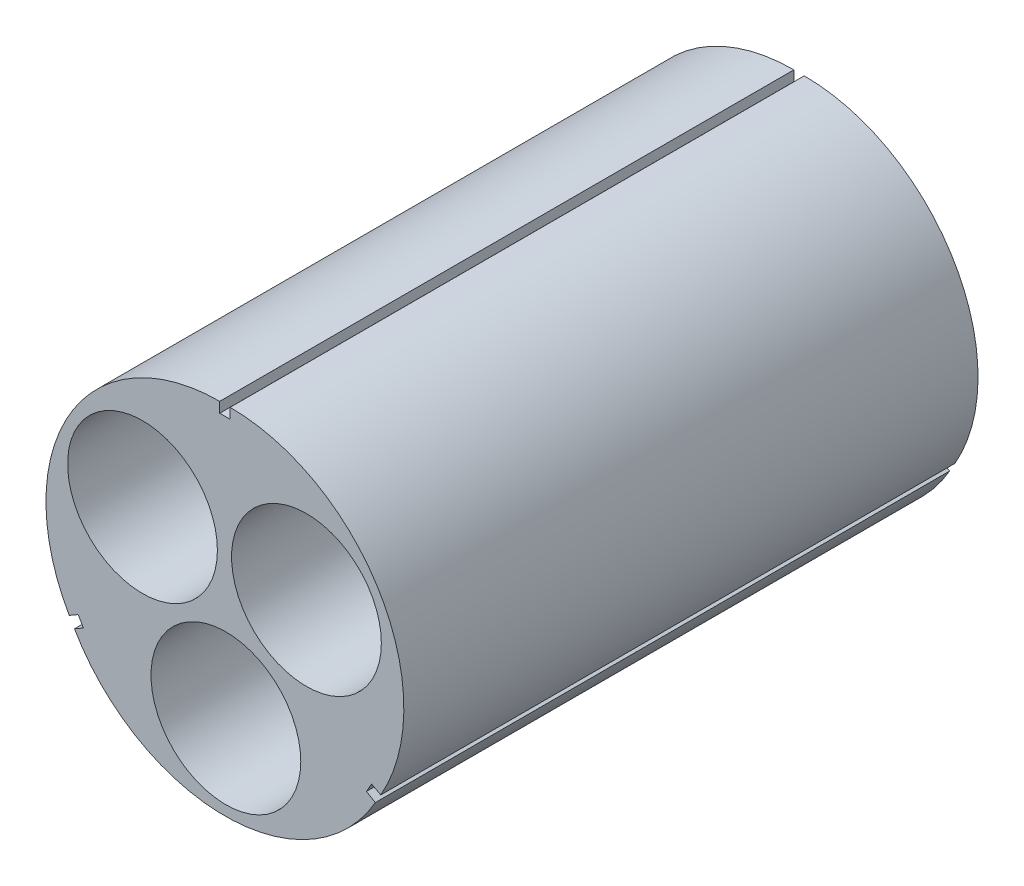
ISO-10303-21;
HEADER;
FILE_DESCRIPTION(('STEP AP214'),'2;1');
FILE_NAME('part.step','',(''),(''),'','','');
FILE_SCHEMA(('AUTOMOTIVE_DESIGN { 1 0 10303 214 1 1 1 1 }'));
ENDSEC;
DATA;
#1=APPLICATION_CONTEXT('core data for automotive mechanical design processes');
#2=APPLICATION_PROTOCOL_DEFINITION('international standard','automotive_design',2000,#1);
#3=PRODUCT_CONTEXT('',#1,'mechanical');
#4=PRODUCT('Part','Part','',(#3));
#5=PRODUCT_RELATED_PRODUCT_CATEGORY('part','',(#4));
#6=PRODUCT_DEFINITION_FORMATION('','',#4);
#7=PRODUCT_DEFINITION_CONTEXT('part definition',#1,'design');
#8=PRODUCT_DEFINITION('design','',#6,#7);
#9=PRODUCT_DEFINITION_SHAPE('','',#8);
#10=(LENGTH_UNIT() NAMED_UNIT(*) SI_UNIT(.MILLI.,.METRE.));
#11=(NAMED_UNIT(*) PLANE_ANGLE_UNIT() SI_UNIT($,.RADIAN.));
#12=(NAMED_UNIT(*) SI_UNIT($,.STERADIAN.) SOLID_ANGLE_UNIT());
#13=UNCERTAINTY_MEASURE_WITH_UNIT(LENGTH_MEASURE(1.E-05),#10,'distance_accuracy_value','');
#14=(GEOMETRIC_REPRESENTATION_CONTEXT(3) GLOBAL_UNCERTAINTY_ASSIGNED_CONTEXT((#13)) GLOBAL_UNIT_ASSIGNED_CONTEXT((#10,
#11,#12)) REPRESENTATION_CONTEXT('',''));
#15=CARTESIAN_POINT('',(0.,0.,0.));
#16=DIRECTION('',(0.,0.,1.));
#17=DIRECTION('',(1.,0.,0.));
#18=AXIS2_PLACEMENT_3D('',#15,#16,#17);
#19=CARTESIAN_POINT('',(0.634999999997387,0.367389914464188,70.104));
#20=DIRECTION('',(0.,0.,-1.));
#21=DIRECTION('',(-1.,0.,0.));
#22=AXIS2_PLACEMENT_3D('',#19,#20,#21);
#23=PLANE('',#22);
#24=DIRECTION('',(-1.,0.,0.));
#25=VECTOR('',#24,1.);
#26=CARTESIAN_POINT('',(0.,20.32,70.104));
#27=LINE('',#26,#25);
#28=CARTESIAN_POINT('',(0.634999999997387,20.32,70.104));
#29=VERTEX_POINT('',#28);
#30=CARTESIAN_POINT('',(-0.635,20.32,70.104));
#31=VERTEX_POINT('',#30);
#32=EDGE_CURVE('E104',#29,#31,#27,.T.);
#33=ORIENTED_EDGE('',*,*,#32,.T.);
#34=DIRECTION('',(-1.0380533114416E-13,1.,0.));
#35=VECTOR('',#34,1.);
#36=CARTESIAN_POINT('',(-0.635,20.32,70.104));
#37=LINE('',#36,#35);
#38=CARTESIAN_POINT('',(-0.635000000000131,21.5806597443176,70.104));
#39=VERTEX_POINT('',#38);
#40=EDGE_CURVE('E245',#31,#39,#37,.T.);
#41=ORIENTED_EDGE('',*,*,#40,.T.);
#42=CARTESIAN_POINT('',(-0.635,0.366617420935411,70.104));
#43=DIRECTION('',(0.,0.,1.));
#44=DIRECTION('',(1.,0.,0.));
#45=AXIS2_PLACEMENT_3D('',#42,#43,#44);
#46=CIRCLE('',#45,21.2140423233821);
#47=CARTESIAN_POINT('',(-19.0068995690071,-10.2404037407557,70.104));
#48=VERTEX_POINT('',#47);
#49=EDGE_CURVE('E206',#39,#48,#46,.T.);
#50=ORIENTED_EDGE('',*,*,#49,.T.);
#51=DIRECTION('',(0.866025403784438,0.500000000000001,0.));
#52=VECTOR('',#51,1.);
#53=CARTESIAN_POINT('',(-17.9151362048997,-9.61007386859698,70.104));
#54=LINE('',#53,#52);
#55=CARTESIAN_POINT('',(-17.9151362048997,-9.61007386859698,70.104));
#56=VERTEX_POINT('',#55);
#57=EDGE_CURVE('E224',#48,#56,#54,.T.);
#58=ORIENTED_EDGE('',*,*,#57,.T.);
#59=DIRECTION('',(0.500000000000004,-0.866025403784436,0.));
#60=VECTOR('',#59,1.);
#61=CARTESIAN_POINT('',(-17.5976362048997,-10.1600000000001,70.104));
#62=LINE('',#61,#60);
#63=CARTESIAN_POINT('',(-17.2801362048997,-10.7099261314032,70.104));
#64=VERTEX_POINT('',#63);
#65=EDGE_CURVE('E221',#56,#64,#62,.T.);
#66=ORIENTED_EDGE('',*,*,#65,.T.);
#67=DIRECTION('',(-0.866025403784435,-0.500000000000007,0.));
#68=VECTOR('',#67,1.);
#69=CARTESIAN_POINT('',(-17.2801362048997,-10.7099261314032,70.104));
#70=LINE('',#69,#68);
#71=CARTESIAN_POINT('',(-18.371899569007,-11.3402560035619,70.104));
#72=VERTEX_POINT('',#71);
#73=EDGE_CURVE('E223',#64,#72,#70,.T.);
#74=ORIENTED_EDGE('',*,*,#73,.T.);
#75=CARTESIAN_POINT('',(-3.06256712231732E-13,-0.73323484187037,70.104));
#76=DIRECTION('',(0.,0.,1.));
#77=DIRECTION('',(-1.,0.,0.));
#78=AXIS2_PLACEMENT_3D('',#75,#76,#77);
#79=CIRCLE('',#78,21.2140423233818);
#80=CARTESIAN_POINT('',(18.3718995690067,-11.3402560035613,70.104));
#81=VERTEX_POINT('',#80);
#82=EDGE_CURVE('E226',#72,#81,#79,.T.);
#83=ORIENTED_EDGE('',*,*,#82,.T.);
#84=DIRECTION('',(-0.866025403784436,0.500000000000004,0.));
#85=VECTOR('',#84,1.);
#86=CARTESIAN_POINT('',(17.2801362048999,-10.7099261314029,70.104));
#87=LINE('',#86,#85);
#88=CARTESIAN_POINT('',(17.2801362048999,-10.7099261314029,70.104));
#89=VERTEX_POINT('',#88);
#90=EDGE_CURVE('E232',#81,#89,#87,.T.);
#91=ORIENTED_EDGE('',*,*,#90,.T.);
#92=DIRECTION('',(0.500000000000005,0.866025403784436,0.));
#93=VECTOR('',#92,1.);
#94=CARTESIAN_POINT('',(17.5976362048998,-10.1600000000001,70.104));
#95=LINE('',#94,#93);
#96=CARTESIAN_POINT('',(17.9151362048998,-9.61007386859697,70.104));
#97=VERTEX_POINT('',#96);
#98=EDGE_CURVE('E136',#89,#97,#95,.T.);
#99=ORIENTED_EDGE('',*,*,#98,.T.);
#100=DIRECTION('',(0.881220225469593,-0.472705949003521,0.));
#101=VECTOR('',#100,1.);
#102=CARTESIAN_POINT('',(17.9151362048998,-9.61007386859697,70.104));
#103=LINE('',#102,#101);
#104=CARTESIAN_POINT('',(19.0255446678886,-10.2057214389861,70.104));
#105=VERTEX_POINT('',#104);
#106=EDGE_CURVE('E130',#97,#105,#103,.T.);
#107=ORIENTED_EDGE('',*,*,#106,.T.);
#108=CARTESIAN_POINT('',(0.634999999997387,0.367389914464188,70.104));
#109=DIRECTION('',(0.,0.,1.));
#110=DIRECTION('',(-1.,0.,0.));
#111=AXIS2_PLACEMENT_3D('',#108,#109,#110);
#112=CIRCLE('',#111,21.2132698298533);
#113=CARTESIAN_POINT('',(0.634999999997385,21.5806597443175,70.104));
#114=VERTEX_POINT('',#113);
#115=EDGE_CURVE('E134',#105,#114,#112,.T.);
#116=ORIENTED_EDGE('',*,*,#115,.T.);
#117=DIRECTION('',(0.,-1.,0.));
#118=VECTOR('',#117,1.);
#119=CARTESIAN_POINT('',(0.634999999997387,20.32,70.104));
#120=LINE('',#119,#118);
#121=EDGE_CURVE('E50',#114,#29,#120,.T.);
#122=ORIENTED_EDGE('',*,*,#121,.T.);
#123=EDGE_LOOP('',(#33,#41,#50,#58,#66,#74,#83,#91,#99,#107,#116,#122));
#124=FACE_BOUND('',#123,.T.);
#125=CARTESIAN_POINT('',(0.118855303980422,-11.557,70.104));
#126=DIRECTION('',(0.,0.,1.));
#127=DIRECTION('',(1.,0.,0.));
#128=AXIS2_PLACEMENT_3D('',#125,#126,#127);
#129=CIRCLE('',#128,9.144);
#130=CARTESIAN_POINT('',(9.26285530398042,-11.557,70.104));
#131=VERTEX_POINT('',#130);
#132=EDGE_CURVE('E156',#131,#131,#129,.T.);
#133=ORIENTED_EDGE('',*,*,#132,.F.);
#134=EDGE_LOOP('',(#133));
#135=FACE_BOUND('',#134,.T.);
#136=CARTESIAN_POINT('',(9.95557947936446,5.86947069419869,70.104));
#137=DIRECTION('',(0.,0.,1.));
#138=DIRECTION('',(1.,0.,0.));
#139=AXIS2_PLACEMENT_3D('',#136,#137,#138);
#140=CIRCLE('',#139,9.144);
#141=CARTESIAN_POINT('',(19.0995794793645,5.86947069419869,70.104));
#142=VERTEX_POINT('',#141);
#143=EDGE_CURVE('E418',#142,#142,#140,.T.);
#144=ORIENTED_EDGE('',*,*,#143,.F.);
#145=EDGE_LOOP('',(#144));
#146=FACE_BOUND('',#145,.T.);
#147=CARTESIAN_POINT('',(-10.0609004676266,5.68704939142529,70.104));
#148=DIRECTION('',(0.,0.,1.));
#149=DIRECTION('',(1.,0.,0.));
#150=AXIS2_PLACEMENT_3D('',#147,#148,#149);
#151=CIRCLE('',#150,9.144);
#152=CARTESIAN_POINT('',(-0.916900467626609,5.68704939142529,70.104));
#153=VERTEX_POINT('',#152);
#154=EDGE_CURVE('E409',#153,#153,#151,.T.);
#155=ORIENTED_EDGE('',*,*,#154,.F.);
#156=EDGE_LOOP('',(#155));
#157=FACE_BOUND('',#156,.T.);
#158=ADVANCED_FACE('F33',(#124,#135,#146,#157),#23,.F.);
#159=CARTESIAN_POINT('',(0.634999999997387,0.367389914464188,0.));
#160=DIRECTION('',(0.,0.,-1.));
#161=DIRECTION('',(-1.,0.,0.));
#162=AXIS2_PLACEMENT_3D('',#159,#160,#161);
#163=PLANE('',#162);
#164=CARTESIAN_POINT('',(9.95557947936446,5.86947069419869,0.));
#165=DIRECTION('',(0.,0.,1.));
#166=DIRECTION('',(1.,0.,0.));
#167=AXIS2_PLACEMENT_3D('',#164,#165,#166);
#168=CIRCLE('',#167,9.144);
#169=CARTESIAN_POINT('',(19.0995794793645,5.86947069419869,0.));
#170=VERTEX_POINT('',#169);
#171=EDGE_CURVE('E415',#170,#170,#168,.T.);
#172=ORIENTED_EDGE('',*,*,#171,.T.);
#173=EDGE_LOOP('',(#172));
#174=FACE_BOUND('',#173,.T.);
#175=DIRECTION('',(-1.,0.,0.));
#176=VECTOR('',#175,1.);
#177=CARTESIAN_POINT('',(0.,20.32,0.));
#178=LINE('',#177,#176);
#179=CARTESIAN_POINT('',(0.634999999997387,20.32,0.));
#180=VERTEX_POINT('',#179);
#181=CARTESIAN_POINT('',(-0.635,20.32,0.));
#182=VERTEX_POINT('',#181);
#183=EDGE_CURVE('E98',#180,#182,#178,.T.);
#184=ORIENTED_EDGE('',*,*,#183,.F.);
#185=DIRECTION('',(0.,-1.,0.));
#186=VECTOR('',#185,1.);
#187=CARTESIAN_POINT('',(0.634999999997387,20.32,0.));
#188=LINE('',#187,#186);
#189=CARTESIAN_POINT('',(0.634999999997385,21.5806597443175,0.));
#190=VERTEX_POINT('',#189);
#191=EDGE_CURVE('E176',#190,#180,#188,.T.);
#192=ORIENTED_EDGE('',*,*,#191,.F.);
#193=CARTESIAN_POINT('',(0.634999999997387,0.367389914464188,0.));
#194=DIRECTION('',(0.,0.,1.));
#195=DIRECTION('',(-1.,0.,0.));
#196=AXIS2_PLACEMENT_3D('',#193,#194,#195);
#197=CIRCLE('',#196,21.2132698298533);
#198=CARTESIAN_POINT('',(19.0255446678886,-10.2057214389861,0.));
#199=VERTEX_POINT('',#198);
#200=EDGE_CURVE('E91',#199,#190,#197,.T.);
#201=ORIENTED_EDGE('',*,*,#200,.F.);
#202=DIRECTION('',(0.881220225469593,-0.472705949003521,0.));
#203=VECTOR('',#202,1.);
#204=CARTESIAN_POINT('',(17.9151362048998,-9.61007386859697,0.));
#205=LINE('',#204,#203);
#206=CARTESIAN_POINT('',(17.9151362048998,-9.61007386859697,0.));
#207=VERTEX_POINT('',#206);
#208=EDGE_CURVE('E144',#207,#199,#205,.T.);
#209=ORIENTED_EDGE('',*,*,#208,.F.);
#210=DIRECTION('',(0.500000000000003,0.866025403784437,0.));
#211=VECTOR('',#210,1.);
#212=CARTESIAN_POINT('',(17.5976362048998,-10.1600000000001,0.));
#213=LINE('',#212,#211);
#214=CARTESIAN_POINT('',(17.2801362048999,-10.7099261314029,0.));
#215=VERTEX_POINT('',#214);
#216=EDGE_CURVE('E172',#215,#207,#213,.T.);
#217=ORIENTED_EDGE('',*,*,#216,.F.);
#218=DIRECTION('',(-0.866025403784436,0.500000000000004,0.));
#219=VECTOR('',#218,1.);
#220=CARTESIAN_POINT('',(17.2801362048999,-10.7099261314029,0.));
#221=LINE('',#220,#219);
#222=CARTESIAN_POINT('',(18.3718995690067,-11.3402560035613,0.));
#223=VERTEX_POINT('',#222);
#224=EDGE_CURVE('E169',#223,#215,#221,.T.);
#225=ORIENTED_EDGE('',*,*,#224,.F.);
#226=CARTESIAN_POINT('',(-3.06256712231732E-13,-0.73323484187037,0.));
#227=DIRECTION('',(0.,0.,1.));
#228=DIRECTION('',(-1.,0.,0.));
#229=AXIS2_PLACEMENT_3D('',#226,#227,#228);
#230=CIRCLE('',#229,21.2140423233818);
#231=CARTESIAN_POINT('',(-18.371899569007,-11.3402560035619,0.));
#232=VERTEX_POINT('',#231);
#233=EDGE_CURVE('E167',#232,#223,#230,.T.);
#234=ORIENTED_EDGE('',*,*,#233,.F.);
#235=DIRECTION('',(-0.866025403784435,-0.500000000000007,0.));
#236=VECTOR('',#235,1.);
#237=CARTESIAN_POINT('',(-17.2801362048997,-10.7099261314032,0.));
#238=LINE('',#237,#236);
#239=CARTESIAN_POINT('',(-17.2801362048997,-10.7099261314032,0.));
#240=VERTEX_POINT('',#239);
#241=EDGE_CURVE('E165',#240,#232,#238,.T.);
#242=ORIENTED_EDGE('',*,*,#241,.F.);
#243=DIRECTION('',(0.500000000000006,-0.866025403784435,0.));
#244=VECTOR('',#243,1.);
#245=CARTESIAN_POINT('',(-17.5976362048997,-10.1600000000001,0.));
#246=LINE('',#245,#244);
#247=CARTESIAN_POINT('',(-17.9151362048997,-9.61007386859698,0.));
#248=VERTEX_POINT('',#247);
#249=EDGE_CURVE('E163',#248,#240,#246,.T.);
#250=ORIENTED_EDGE('',*,*,#249,.F.);
#251=DIRECTION('',(0.866025403784438,0.500000000000001,0.));
#252=VECTOR('',#251,1.);
#253=CARTESIAN_POINT('',(-17.9151362048997,-9.61007386859698,0.));
#254=LINE('',#253,#252);
#255=CARTESIAN_POINT('',(-19.0068995690071,-10.2404037407557,0.));
#256=VERTEX_POINT('',#255);
#257=EDGE_CURVE('E160',#256,#248,#254,.T.);
#258=ORIENTED_EDGE('',*,*,#257,.F.);
#259=CARTESIAN_POINT('',(-0.635,0.366617420935411,0.));
#260=DIRECTION('',(0.,0.,1.));
#261=DIRECTION('',(1.,0.,0.));
#262=AXIS2_PLACEMENT_3D('',#259,#260,#261);
#263=CIRCLE('',#262,21.2140423233821);
#264=CARTESIAN_POINT('',(-0.635000000000131,21.5806597443176,0.));
#265=VERTEX_POINT('',#264);
#266=EDGE_CURVE('E158',#265,#256,#263,.T.);
#267=ORIENTED_EDGE('',*,*,#266,.F.);
#268=DIRECTION('',(-1.0380533114416E-13,1.,0.));
#269=VECTOR('',#268,1.);
#270=CARTESIAN_POINT('',(-0.635,20.32,0.));
#271=LINE('',#270,#269);
#272=EDGE_CURVE('E155',#182,#265,#271,.T.);
#273=ORIENTED_EDGE('',*,*,#272,.F.);
#274=EDGE_LOOP('',(#184,#192,#201,#209,#217,#225,#234,#242,#250,#258,#267,#273));
#275=FACE_BOUND('',#274,.T.);
#276=CARTESIAN_POINT('',(0.118855303980422,-11.557,0.));
#277=DIRECTION('',(0.,0.,1.));
#278=DIRECTION('',(1.,0.,0.));
#279=AXIS2_PLACEMENT_3D('',#276,#277,#278);
#280=CIRCLE('',#279,9.144);
#281=CARTESIAN_POINT('',(9.26285530398042,-11.557,0.));
#282=VERTEX_POINT('',#281);
#283=EDGE_CURVE('E249',#282,#282,#280,.T.);
#284=ORIENTED_EDGE('',*,*,#283,.T.);
#285=EDGE_LOOP('',(#284));
#286=FACE_BOUND('',#285,.T.);
#287=CARTESIAN_POINT('',(-10.0609004676266,5.68704939142529,0.));
#288=DIRECTION('',(0.,0.,1.));
#289=DIRECTION('',(1.,0.,0.));
#290=AXIS2_PLACEMENT_3D('',#287,#288,#289);
#291=CIRCLE('',#290,9.144);
#292=CARTESIAN_POINT('',(-0.916900467626609,5.68704939142529,0.));
#293=VERTEX_POINT('',#292);
#294=EDGE_CURVE('E412',#293,#293,#291,.T.);
#295=ORIENTED_EDGE('',*,*,#294,.T.);
#296=EDGE_LOOP('',(#295));
#297=FACE_BOUND('',#296,.T.);
#298=ADVANCED_FACE('F210',(#174,#275,#286,#297),#163,.T.);
#299=CARTESIAN_POINT('',(0.,20.32,70.104));
#300=DIRECTION('',(0.,-1.,0.));
#301=DIRECTION('',(0.,0.,-1.));
#302=AXIS2_PLACEMENT_3D('',#299,#300,#301);
#303=PLANE('',#302);
#304=ORIENTED_EDGE('',*,*,#183,.T.);
#305=DIRECTION('',(0.,0.,-1.));
#306=VECTOR('',#305,1.);
#307=CARTESIAN_POINT('',(-0.635,20.32,70.104));
#308=LINE('',#307,#306);
#309=EDGE_CURVE('E11',#31,#182,#308,.T.);
#310=ORIENTED_EDGE('',*,*,#309,.F.);
#311=ORIENTED_EDGE('',*,*,#32,.F.);
#312=DIRECTION('',(0.,0.,-1.));
#313=VECTOR('',#312,1.);
#314=CARTESIAN_POINT('',(0.634999999997387,20.32,70.104));
#315=LINE('',#314,#313);
#316=EDGE_CURVE('E150',#29,#180,#315,.T.);
#317=ORIENTED_EDGE('',*,*,#316,.T.);
#318=EDGE_LOOP('',(#304,#310,#311,#317));
#319=FACE_BOUND('',#318,.T.);
#320=ADVANCED_FACE('F35',(#319),#303,.F.);
#321=CARTESIAN_POINT('',(-0.635,20.32,70.104));
#322=DIRECTION('',(-1.,-1.0380533114416E-13,0.));
#323=DIRECTION('',(1.0380533114416E-13,-1.,0.));
#324=AXIS2_PLACEMENT_3D('',#321,#322,#323);
#325=PLANE('',#324);
#326=ORIENTED_EDGE('',*,*,#272,.T.);
#327=DIRECTION('',(0.,0.,-1.));
#328=VECTOR('',#327,1.);
#329=CARTESIAN_POINT('',(-0.635000000000131,21.5806597443176,70.104));
#330=LINE('',#329,#328);
#331=EDGE_CURVE('E42',#39,#265,#330,.T.);
#332=ORIENTED_EDGE('',*,*,#331,.F.);
#333=ORIENTED_EDGE('',*,*,#40,.F.);
#334=ORIENTED_EDGE('',*,*,#309,.T.);
#335=EDGE_LOOP('',(#326,#332,#333,#334));
#336=FACE_BOUND('',#335,.T.);
#337=ADVANCED_FACE('F251',(#336),#325,.F.);
#338=CARTESIAN_POINT('',(-0.635,0.366617420935411,70.104));
#339=DIRECTION('',(0.,0.,-1.));
#340=DIRECTION('',(-1.,0.,0.));
#341=AXIS2_PLACEMENT_3D('',#338,#339,#340);
#342=CYLINDRICAL_SURFACE('',#341,21.2140423233821);
#343=ORIENTED_EDGE('',*,*,#266,.T.);
#344=DIRECTION('',(0.,0.,-1.));
#345=VECTOR('',#344,1.);
#346=CARTESIAN_POINT('',(-19.0068995690071,-10.2404037407557,70.104));
#347=LINE('',#346,#345);
#348=EDGE_CURVE('E197',#48,#256,#347,.T.);
#349=ORIENTED_EDGE('',*,*,#348,.F.);
#350=ORIENTED_EDGE('',*,*,#49,.F.);
#351=ORIENTED_EDGE('',*,*,#331,.T.);
#352=EDGE_LOOP('',(#343,#349,#350,#351));
#353=FACE_BOUND('',#352,.T.);
#354=ADVANCED_FACE('F204',(#353),#342,.T.);
#355=CARTESIAN_POINT('',(-17.9151362048997,-9.61007386859698,70.104));
#356=DIRECTION('',(-0.500000000000001,0.866025403784438,0.));
#357=DIRECTION('',(-0.866025403784438,-0.500000000000001,0.));
#358=AXIS2_PLACEMENT_3D('',#355,#356,#357);
#359=PLANE('',#358);
#360=ORIENTED_EDGE('',*,*,#257,.T.);
#361=DIRECTION('',(0.,0.,-1.));
#362=VECTOR('',#361,1.);
#363=CARTESIAN_POINT('',(-17.9151362048997,-9.61007386859698,70.104));
#364=LINE('',#363,#362);
#365=EDGE_CURVE('E194',#56,#248,#364,.T.);
#366=ORIENTED_EDGE('',*,*,#365,.F.);
#367=ORIENTED_EDGE('',*,*,#57,.F.);
#368=ORIENTED_EDGE('',*,*,#348,.T.);
#369=EDGE_LOOP('',(#360,#366,#367,#368));
#370=FACE_BOUND('',#369,.T.);
#371=ADVANCED_FACE('F215',(#370),#359,.F.);
#372=CARTESIAN_POINT('',(-17.5976362048997,-10.1600000000001,70.104));
#373=DIRECTION('',(0.866025403784435,0.500000000000006,0.));
#374=DIRECTION('',(-0.500000000000006,0.866025403784435,0.));
#375=AXIS2_PLACEMENT_3D('',#372,#373,#374);
#376=PLANE('',#375);
#377=ORIENTED_EDGE('',*,*,#249,.T.);
#378=DIRECTION('',(0.,0.,-1.));
#379=VECTOR('',#378,1.);
#380=CARTESIAN_POINT('',(-17.2801362048997,-10.7099261314032,70.104));
#381=LINE('',#380,#379);
#382=EDGE_CURVE('E191',#64,#240,#381,.T.);
#383=ORIENTED_EDGE('',*,*,#382,.F.);
#384=ORIENTED_EDGE('',*,*,#65,.F.);
#385=ORIENTED_EDGE('',*,*,#365,.T.);
#386=EDGE_LOOP('',(#377,#383,#384,#385));
#387=FACE_BOUND('',#386,.T.);
#388=ADVANCED_FACE('F219',(#387),#376,.F.);
#389=CARTESIAN_POINT('',(-17.2801362048997,-10.7099261314032,70.104));
#390=DIRECTION('',(0.500000000000007,-0.866025403784435,0.));
#391=DIRECTION('',(0.866025403784435,0.500000000000007,0.));
#392=AXIS2_PLACEMENT_3D('',#389,#390,#391);
#393=PLANE('',#392);
#394=ORIENTED_EDGE('',*,*,#241,.T.);
#395=DIRECTION('',(0.,0.,-1.));
#396=VECTOR('',#395,1.);
#397=CARTESIAN_POINT('',(-18.371899569007,-11.3402560035619,70.104));
#398=LINE('',#397,#396);
#399=EDGE_CURVE('E188',#72,#232,#398,.T.);
#400=ORIENTED_EDGE('',*,*,#399,.F.);
#401=ORIENTED_EDGE('',*,*,#73,.F.);
#402=ORIENTED_EDGE('',*,*,#382,.T.);
#403=EDGE_LOOP('',(#394,#400,#401,#402));
#404=FACE_BOUND('',#403,.T.);
#405=ADVANCED_FACE('F282',(#404),#393,.F.);
#406=CARTESIAN_POINT('',(-3.06256712231732E-13,-0.73323484187037,70.104));
#407=DIRECTION('',(0.,0.,-1.));
#408=DIRECTION('',(-1.,0.,0.));
#409=AXIS2_PLACEMENT_3D('',#406,#407,#408);
#410=CYLINDRICAL_SURFACE('',#409,21.2140423233818);
#411=ORIENTED_EDGE('',*,*,#233,.T.);
#412=DIRECTION('',(0.,0.,-1.));
#413=VECTOR('',#412,1.);
#414=CARTESIAN_POINT('',(18.3718995690067,-11.3402560035613,70.104));
#415=LINE('',#414,#413);
#416=EDGE_CURVE('E185',#81,#223,#415,.T.);
#417=ORIENTED_EDGE('',*,*,#416,.F.);
#418=ORIENTED_EDGE('',*,*,#82,.F.);
#419=ORIENTED_EDGE('',*,*,#399,.T.);
#420=EDGE_LOOP('',(#411,#417,#418,#419));
#421=FACE_BOUND('',#420,.T.);
#422=ADVANCED_FACE('F279',(#421),#410,.T.);
#423=CARTESIAN_POINT('',(17.2801362048999,-10.7099261314029,70.104));
#424=DIRECTION('',(-0.500000000000004,-0.866025403784436,0.));
#425=DIRECTION('',(0.866025403784437,-0.500000000000004,0.));
#426=AXIS2_PLACEMENT_3D('',#423,#424,#425);
#427=PLANE('',#426);
#428=ORIENTED_EDGE('',*,*,#224,.T.);
#429=DIRECTION('',(0.,0.,-1.));
#430=VECTOR('',#429,1.);
#431=CARTESIAN_POINT('',(17.2801362048999,-10.7099261314029,70.104));
#432=LINE('',#431,#430);
#433=EDGE_CURVE('E182',#89,#215,#432,.T.);
#434=ORIENTED_EDGE('',*,*,#433,.F.);
#435=ORIENTED_EDGE('',*,*,#90,.F.);
#436=ORIENTED_EDGE('',*,*,#416,.T.);
#437=EDGE_LOOP('',(#428,#434,#435,#436));
#438=FACE_BOUND('',#437,.T.);
#439=ADVANCED_FACE('F238',(#438),#427,.F.);
#440=CARTESIAN_POINT('',(17.5976362048998,-10.1600000000001,70.104));
#441=DIRECTION('',(-0.866025403784437,0.500000000000003,0.));
#442=DIRECTION('',(-0.500000000000003,-0.866025403784437,0.));
#443=AXIS2_PLACEMENT_3D('',#440,#441,#442);
#444=PLANE('',#443);
#445=ORIENTED_EDGE('',*,*,#216,.T.);
#446=DIRECTION('',(0.,0.,-1.));
#447=VECTOR('',#446,1.);
#448=CARTESIAN_POINT('',(17.9151362048998,-9.61007386859697,70.104));
#449=LINE('',#448,#447);
#450=EDGE_CURVE('E145',#97,#207,#449,.T.);
#451=ORIENTED_EDGE('',*,*,#450,.F.);
#452=ORIENTED_EDGE('',*,*,#98,.F.);
#453=ORIENTED_EDGE('',*,*,#433,.T.);
#454=EDGE_LOOP('',(#445,#451,#452,#453));
#455=FACE_BOUND('',#454,.T.);
#456=ADVANCED_FACE('F241',(#455),#444,.F.);
#457=CARTESIAN_POINT('',(17.9151362048998,-9.61007386859697,70.104));
#458=DIRECTION('',(0.472705949003521,0.881220225469593,0.));
#459=DIRECTION('',(-0.881220225469593,0.472705949003521,0.));
#460=AXIS2_PLACEMENT_3D('',#457,#458,#459);
#461=PLANE('',#460);
#462=ORIENTED_EDGE('',*,*,#208,.T.);
#463=DIRECTION('',(0.,0.,-1.));
#464=VECTOR('',#463,1.);
#465=CARTESIAN_POINT('',(19.0255446678886,-10.2057214389861,70.104));
#466=LINE('',#465,#464);
#467=EDGE_CURVE('E141',#105,#199,#466,.T.);
#468=ORIENTED_EDGE('',*,*,#467,.F.);
#469=ORIENTED_EDGE('',*,*,#106,.F.);
#470=ORIENTED_EDGE('',*,*,#450,.T.);
#471=EDGE_LOOP('',(#462,#468,#469,#470));
#472=FACE_BOUND('',#471,.T.);
#473=ADVANCED_FACE('F142',(#472),#461,.F.);
#474=CARTESIAN_POINT('',(0.634999999997387,0.367389914464188,70.104));
#475=DIRECTION('',(0.,0.,-1.));
#476=DIRECTION('',(-1.,0.,0.));
#477=AXIS2_PLACEMENT_3D('',#474,#475,#476);
#478=CYLINDRICAL_SURFACE('',#477,21.2132698298533);
#479=ORIENTED_EDGE('',*,*,#200,.T.);
#480=DIRECTION('',(0.,0.,-1.));
#481=VECTOR('',#480,1.);
#482=CARTESIAN_POINT('',(0.634999999997385,21.5806597443175,70.104));
#483=LINE('',#482,#481);
#484=EDGE_CURVE('E146',#114,#190,#483,.T.);
#485=ORIENTED_EDGE('',*,*,#484,.F.);
#486=ORIENTED_EDGE('',*,*,#115,.F.);
#487=ORIENTED_EDGE('',*,*,#467,.T.);
#488=EDGE_LOOP('',(#479,#485,#486,#487));
#489=FACE_BOUND('',#488,.T.);
#490=ADVANCED_FACE('F148',(#489),#478,.T.);
#491=CARTESIAN_POINT('',(0.634999999997387,20.32,70.104));
#492=DIRECTION('',(1.,0.,0.));
#493=DIRECTION('',(0.,1.,0.));
#494=AXIS2_PLACEMENT_3D('',#491,#492,#493);
#495=PLANE('',#494);
#496=ORIENTED_EDGE('',*,*,#191,.T.);
#497=ORIENTED_EDGE('',*,*,#316,.F.);
#498=ORIENTED_EDGE('',*,*,#121,.F.);
#499=ORIENTED_EDGE('',*,*,#484,.T.);
#500=EDGE_LOOP('',(#496,#497,#498,#499));
#501=FACE_BOUND('',#500,.T.);
#502=ADVANCED_FACE('F243',(#501),#495,.F.);
#503=CARTESIAN_POINT('',(0.118855303980422,-11.557,70.104));
#504=DIRECTION('',(0.,0.,-1.));
#505=DIRECTION('',(-1.,0.,0.));
#506=AXIS2_PLACEMENT_3D('',#503,#504,#505);
#507=CYLINDRICAL_SURFACE('',#506,9.144);
#508=ORIENTED_EDGE('',*,*,#132,.T.);
#509=EDGE_LOOP('',(#508));
#510=FACE_BOUND('',#509,.T.);
#511=ORIENTED_EDGE('',*,*,#283,.F.);
#512=EDGE_LOOP('',(#511));
#513=FACE_BOUND('',#512,.T.);
#514=ADVANCED_FACE('F266',(#510,#513),#507,.F.);
#515=CARTESIAN_POINT('',(9.95557947936446,5.86947069419869,70.104));
#516=DIRECTION('',(0.,0.,-1.));
#517=DIRECTION('',(-1.,0.,0.));
#518=AXIS2_PLACEMENT_3D('',#515,#516,#517);
#519=CYLINDRICAL_SURFACE('',#518,9.144);
#520=ORIENTED_EDGE('',*,*,#143,.T.);
#521=EDGE_LOOP('',(#520));
#522=FACE_BOUND('',#521,.T.);
#523=ORIENTED_EDGE('',*,*,#171,.F.);
#524=EDGE_LOOP('',(#523));
#525=FACE_BOUND('',#524,.T.);
#526=ADVANCED_FACE('F332',(#522,#525),#519,.F.);
#527=CARTESIAN_POINT('',(-10.0609004676266,5.68704939142529,70.104));
#528=DIRECTION('',(0.,0.,-1.));
#529=DIRECTION('',(-1.,0.,0.));
#530=AXIS2_PLACEMENT_3D('',#527,#528,#529);
#531=CYLINDRICAL_SURFACE('',#530,9.144);
#532=ORIENTED_EDGE('',*,*,#154,.T.);
#533=EDGE_LOOP('',(#532));
#534=FACE_BOUND('',#533,.T.);
#535=ORIENTED_EDGE('',*,*,#294,.F.);
#536=EDGE_LOOP('',(#535));
#537=FACE_BOUND('',#536,.T.);
#538=ADVANCED_FACE('F339',(#534,#537),#531,.F.);
#539=CLOSED_SHELL('',(#158,#298,#320,#337,#354,#371,#388,#405,#422,#439,#456,#473,#490,#502,
#514,#526,#538));
#540=MANIFOLD_SOLID_BREP('B2',#539);
#541=ADVANCED_BREP_SHAPE_REPRESENTATION('',(#18,#540),#14);
#542=SHAPE_DEFINITION_REPRESENTATION(#9,#541);
ENDSEC;
END-ISO-10303-21;
